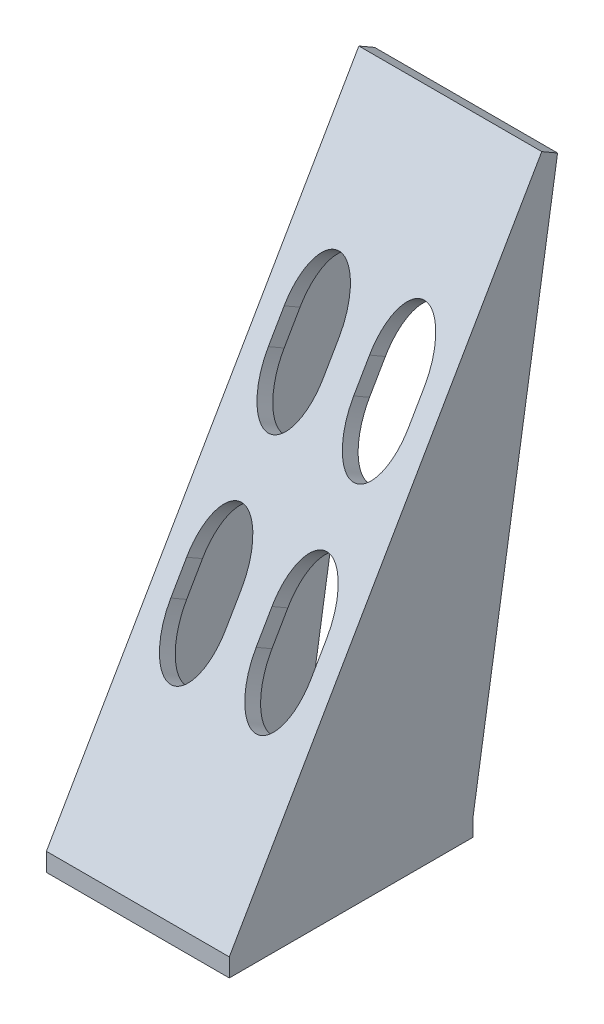
ISO-10303-21;
HEADER;
FILE_DESCRIPTION(('STEP AP214'),'2;1');
FILE_NAME('part.step','',(''),(''),'','','');
FILE_SCHEMA(('AUTOMOTIVE_DESIGN { 1 0 10303 214 1 1 1 1 }'));
ENDSEC;
DATA;
#1=APPLICATION_CONTEXT('core data for automotive mechanical design processes');
#2=APPLICATION_PROTOCOL_DEFINITION('international standard','automotive_design',2000,#1);
#3=PRODUCT_CONTEXT('',#1,'mechanical');
#4=PRODUCT('Part','Part','',(#3));
#5=PRODUCT_RELATED_PRODUCT_CATEGORY('part','',(#4));
#6=PRODUCT_DEFINITION_FORMATION('','',#4);
#7=PRODUCT_DEFINITION_CONTEXT('part definition',#1,'design');
#8=PRODUCT_DEFINITION('design','',#6,#7);
#9=PRODUCT_DEFINITION_SHAPE('','',#8);
#10=(LENGTH_UNIT() NAMED_UNIT(*) SI_UNIT(.MILLI.,.METRE.));
#11=(NAMED_UNIT(*) PLANE_ANGLE_UNIT() SI_UNIT($,.RADIAN.));
#12=(NAMED_UNIT(*) SI_UNIT($,.STERADIAN.) SOLID_ANGLE_UNIT());
#13=UNCERTAINTY_MEASURE_WITH_UNIT(LENGTH_MEASURE(1.E-05),#10,'distance_accuracy_value','');
#14=(GEOMETRIC_REPRESENTATION_CONTEXT(3) GLOBAL_UNCERTAINTY_ASSIGNED_CONTEXT((#13)) GLOBAL_UNIT_ASSIGNED_CONTEXT((#10,
#11,#12)) REPRESENTATION_CONTEXT('',''));
#15=CARTESIAN_POINT('',(0.,0.,0.));
#16=DIRECTION('',(0.,0.,1.));
#17=DIRECTION('',(1.,0.,0.));
#18=AXIS2_PLACEMENT_3D('',#15,#16,#17);
#19=CARTESIAN_POINT('',(6.99999999999998,6.48780366869484,-108.458946838995));
#20=DIRECTION('',(0.,0.500000000000001,0.866025403784438));
#21=DIRECTION('',(0.,-0.866025403784438,0.500000000000001));
#22=AXIS2_PLACEMENT_3D('',#19,#20,#21);
#23=ELLIPSE('',#22,8.99999999999998,4.5);
#24=DIRECTION('',(0.,0.500000000000001,0.866025403784438));
#25=VECTOR('',#24,1.);
#26=SURFACE_OF_LINEAR_EXTRUSION('',#23,#25);
#27=CARTESIAN_POINT('',(7.,62.987803668695,-10.5980762113533));
#28=DIRECTION('',(0.,0.500000000000001,0.866025403784438));
#29=DIRECTION('',(0.,-0.866025403784438,0.500000000000001));
#30=AXIS2_PLACEMENT_3D('',#27,#28,#29);
#31=ELLIPSE('',#30,8.99999999999998,4.5);
#32=CARTESIAN_POINT('',(2.5,62.987803668695,-10.5980762113533));
#33=VERTEX_POINT('',#32);
#34=CARTESIAN_POINT('',(11.5,62.9878036686948,-10.5980762113532));
#35=VERTEX_POINT('',#34);
#36=EDGE_CURVE('E229',#33,#35,#31,.F.);
#37=ORIENTED_EDGE('',*,*,#36,.T.);
#38=DIRECTION('',(0.,-0.500000000000001,-0.866025403784438));
#39=VECTOR('',#38,1.);
#40=CARTESIAN_POINT('',(11.5,120.987803668695,89.8608706276416));
#41=LINE('',#40,#39);
#42=CARTESIAN_POINT('',(11.5,64.4878036686949,-7.99999999999991));
#43=VERTEX_POINT('',#42);
#44=EDGE_CURVE('E836',#43,#35,#41,.T.);
#45=ORIENTED_EDGE('',*,*,#44,.F.);
#46=CARTESIAN_POINT('',(7.,64.487803668695,-8.));
#47=DIRECTION('',(0.,0.500000000000001,0.866025403784438));
#48=DIRECTION('',(0.,-0.866025403784438,0.500000000000001));
#49=AXIS2_PLACEMENT_3D('',#46,#47,#48);
#50=ELLIPSE('',#49,8.99999999999998,4.5);
#51=CARTESIAN_POINT('',(2.5,64.487803668695,-7.99999999999998));
#52=VERTEX_POINT('',#51);
#53=EDGE_CURVE('E356',#52,#43,#50,.F.);
#54=ORIENTED_EDGE('',*,*,#53,.F.);
#55=DIRECTION('',(0.,-0.500000000000001,-0.866025403784438));
#56=VECTOR('',#55,1.);
#57=CARTESIAN_POINT('',(2.50000000000001,120.987803668695,89.8608706276415));
#58=LINE('',#57,#56);
#59=EDGE_CURVE('E835',#52,#33,#58,.T.);
#60=ORIENTED_EDGE('',*,*,#59,.T.);
#61=EDGE_LOOP('',(#37,#45,#54,#60));
#62=FACE_BOUND('',#61,.T.);
#63=ADVANCED_FACE('F37',(#62),#26,.F.);
#64=CARTESIAN_POINT('',(6.99999999999999,-21.2250092524071,-92.4589468389948));
#65=DIRECTION('',(0.,0.500000000000001,0.866025403784438));
#66=DIRECTION('',(0.,-0.866025403784438,0.500000000000001));
#67=AXIS2_PLACEMENT_3D('',#64,#65,#66);
#68=ELLIPSE('',#67,8.99999999999998,4.5);
#69=DIRECTION('',(0.,0.500000000000001,0.866025403784438));
#70=VECTOR('',#69,1.);
#71=SURFACE_OF_LINEAR_EXTRUSION('',#68,#70);
#72=CARTESIAN_POINT('',(7.,35.274990747593,5.40192378864668));
#73=DIRECTION('',(0.,0.500000000000001,0.866025403784438));
#74=DIRECTION('',(0.,-0.866025403784438,0.500000000000001));
#75=AXIS2_PLACEMENT_3D('',#72,#73,#74);
#76=ELLIPSE('',#75,8.99999999999998,4.5);
#77=CARTESIAN_POINT('',(2.5,35.274990747593,5.40192378864667));
#78=VERTEX_POINT('',#77);
#79=CARTESIAN_POINT('',(11.5,35.274990747593,5.40192378864667));
#80=VERTEX_POINT('',#79);
#81=EDGE_CURVE('E236',#78,#80,#76,.F.);
#82=ORIENTED_EDGE('',*,*,#81,.T.);
#83=DIRECTION('',(0.,-0.500000000000001,-0.866025403784438));
#84=VECTOR('',#83,1.);
#85=CARTESIAN_POINT('',(11.5,93.2749907475932,105.860870627641));
#86=LINE('',#85,#84);
#87=CARTESIAN_POINT('',(11.5,36.7749907475931,7.99999999999999));
#88=VERTEX_POINT('',#87);
#89=EDGE_CURVE('E225',#88,#80,#86,.T.);
#90=ORIENTED_EDGE('',*,*,#89,.F.);
#91=CARTESIAN_POINT('',(7.,36.774990747593,8.));
#92=DIRECTION('',(0.,0.500000000000001,0.866025403784438));
#93=DIRECTION('',(0.,-0.866025403784438,0.500000000000001));
#94=AXIS2_PLACEMENT_3D('',#91,#92,#93);
#95=ELLIPSE('',#94,8.99999999999998,4.5);
#96=CARTESIAN_POINT('',(2.5,36.7749907475931,8.00000000000001));
#97=VERTEX_POINT('',#96);
#98=EDGE_CURVE('E360',#97,#88,#95,.F.);
#99=ORIENTED_EDGE('',*,*,#98,.F.);
#100=DIRECTION('',(0.,-0.500000000000001,-0.866025403784438));
#101=VECTOR('',#100,1.);
#102=CARTESIAN_POINT('',(2.50000000000001,93.2749907475932,105.860870627641));
#103=LINE('',#102,#101);
#104=EDGE_CURVE('E387',#97,#78,#103,.T.);
#105=ORIENTED_EDGE('',*,*,#104,.T.);
#106=EDGE_LOOP('',(#82,#90,#99,#105));
#107=FACE_BOUND('',#106,.T.);
#108=ADVANCED_FACE('F246',(#107),#71,.F.);
#109=CARTESIAN_POINT('',(-7.00000000000002,-21.2250092524071,-92.4589468389948));
#110=DIRECTION('',(0.,0.500000000000001,0.866025403784438));
#111=DIRECTION('',(0.,-0.866025403784438,0.500000000000001));
#112=AXIS2_PLACEMENT_3D('',#109,#110,#111);
#113=ELLIPSE('',#112,8.99999999999998,4.5);
#114=DIRECTION('',(0.,0.500000000000001,0.866025403784438));
#115=VECTOR('',#114,1.);
#116=SURFACE_OF_LINEAR_EXTRUSION('',#113,#115);
#117=DIRECTION('',(0.,-0.500000000000001,-0.866025403784438));
#118=VECTOR('',#117,1.);
#119=CARTESIAN_POINT('',(-11.5,93.2749907475931,105.860870627642));
#120=LINE('',#119,#118);
#121=CARTESIAN_POINT('',(-11.5,36.774990747593,8.00000000000002));
#122=VERTEX_POINT('',#121);
#123=CARTESIAN_POINT('',(-11.5,35.274990747593,5.4019237886467));
#124=VERTEX_POINT('',#123);
#125=EDGE_CURVE('E213',#122,#124,#120,.T.);
#126=ORIENTED_EDGE('',*,*,#125,.T.);
#127=CARTESIAN_POINT('',(-7.,35.274990747593,5.40192378864668));
#128=DIRECTION('',(0.,0.500000000000001,0.866025403784438));
#129=DIRECTION('',(0.,-0.866025403784438,0.500000000000001));
#130=AXIS2_PLACEMENT_3D('',#127,#128,#129);
#131=ELLIPSE('',#130,8.99999999999998,4.5);
#132=CARTESIAN_POINT('',(-2.5,35.274990747593,5.4019237886467));
#133=VERTEX_POINT('',#132);
#134=EDGE_CURVE('E222',#124,#133,#131,.F.);
#135=ORIENTED_EDGE('',*,*,#134,.T.);
#136=DIRECTION('',(0.,-0.500000000000001,-0.866025403784438));
#137=VECTOR('',#136,1.);
#138=CARTESIAN_POINT('',(-2.49999999999999,93.2749907475931,105.860870627642));
#139=LINE('',#138,#137);
#140=CARTESIAN_POINT('',(-2.5,36.774990747593,8.00000000000002));
#141=VERTEX_POINT('',#140);
#142=EDGE_CURVE('E202',#141,#133,#139,.T.);
#143=ORIENTED_EDGE('',*,*,#142,.F.);
#144=CARTESIAN_POINT('',(-7.,36.774990747593,8.));
#145=DIRECTION('',(0.,0.500000000000001,0.866025403784438));
#146=DIRECTION('',(0.,-0.866025403784438,0.500000000000001));
#147=AXIS2_PLACEMENT_3D('',#144,#145,#146);
#148=ELLIPSE('',#147,8.99999999999998,4.5);
#149=EDGE_CURVE('E350',#122,#141,#148,.F.);
#150=ORIENTED_EDGE('',*,*,#149,.F.);
#151=EDGE_LOOP('',(#126,#135,#143,#150));
#152=FACE_BOUND('',#151,.T.);
#153=ADVANCED_FACE('F228',(#152),#116,.F.);
#154=CARTESIAN_POINT('',(7.00000000000001,116.487803668695,92.4589468389948));
#155=DIRECTION('',(0.,0.500000000000001,0.866025403784438));
#156=DIRECTION('',(0.,-0.866025403784438,0.500000000000001));
#157=AXIS2_PLACEMENT_3D('',#154,#155,#156);
#158=ELLIPSE('',#157,8.99999999999998,4.5);
#159=DIRECTION('',(0.,-0.500000000000001,-0.866025403784438));
#160=VECTOR('',#159,1.);
#161=SURFACE_OF_LINEAR_EXTRUSION('',#158,#160);
#162=CARTESIAN_POINT('',(7.,59.987803668695,-5.40192378864668));
#163=DIRECTION('',(0.,0.500000000000001,0.866025403784438));
#164=DIRECTION('',(0.,-0.866025403784438,0.500000000000001));
#165=AXIS2_PLACEMENT_3D('',#162,#163,#164);
#166=ELLIPSE('',#165,8.99999999999998,4.5);
#167=CARTESIAN_POINT('',(11.5,59.987803668697,-5.40192378864325));
#168=VERTEX_POINT('',#167);
#169=CARTESIAN_POINT('',(2.5,59.987803668695,-5.40192378864668));
#170=VERTEX_POINT('',#169);
#171=EDGE_CURVE('E531',#168,#170,#166,.F.);
#172=ORIENTED_EDGE('',*,*,#171,.F.);
#173=DIRECTION('',(0.,-0.500000000000001,-0.866025403784438));
#174=VECTOR('',#173,1.);
#175=CARTESIAN_POINT('',(11.5,59.237803668696,-6.70096189432162));
#176=LINE('',#175,#174);
#177=CARTESIAN_POINT('',(11.5,58.487803668695,-8.00000000000002));
#178=VERTEX_POINT('',#177);
#179=EDGE_CURVE('E373',#168,#178,#176,.T.);
#180=ORIENTED_EDGE('',*,*,#179,.T.);
#181=CARTESIAN_POINT('',(7.,58.487803668695,-8.));
#182=DIRECTION('',(0.,-0.500000000000001,-0.866025403784438));
#183=DIRECTION('',(0.,-0.866025403784438,0.500000000000001));
#184=AXIS2_PLACEMENT_3D('',#181,#182,#183);
#185=ELLIPSE('',#184,8.99999999999998,4.5);
#186=CARTESIAN_POINT('',(2.5,58.487803668695,-8.00000000000002));
#187=VERTEX_POINT('',#186);
#188=EDGE_CURVE('E359',#187,#178,#185,.F.);
#189=ORIENTED_EDGE('',*,*,#188,.F.);
#190=DIRECTION('',(0.,-0.500000000000001,-0.866025403784438));
#191=VECTOR('',#190,1.);
#192=CARTESIAN_POINT('',(2.5,59.237803668696,-6.70096189432162));
#193=LINE('',#192,#191);
#194=EDGE_CURVE('E371',#170,#187,#193,.T.);
#195=ORIENTED_EDGE('',*,*,#194,.F.);
#196=EDGE_LOOP('',(#172,#180,#189,#195));
#197=FACE_BOUND('',#196,.T.);
#198=ADVANCED_FACE('F546',(#197),#161,.T.);
#199=CARTESIAN_POINT('',(-6.99999999999999,88.7749907475932,108.458946838995));
#200=DIRECTION('',(0.,0.500000000000001,0.866025403784438));
#201=DIRECTION('',(0.,-0.866025403784438,0.500000000000001));
#202=AXIS2_PLACEMENT_3D('',#199,#200,#201);
#203=ELLIPSE('',#202,8.99999999999998,4.5);
#204=DIRECTION('',(0.,-0.500000000000001,-0.866025403784438));
#205=VECTOR('',#204,1.);
#206=SURFACE_OF_LINEAR_EXTRUSION('',#203,#205);
#207=DIRECTION('',(0.,-0.500000000000001,-0.866025403784438));
#208=VECTOR('',#207,1.);
#209=CARTESIAN_POINT('',(-11.5,31.524990747594,9.29903810567838));
#210=LINE('',#209,#208);
#211=CARTESIAN_POINT('',(-11.5,32.274990747593,10.5980762113533));
#212=VERTEX_POINT('',#211);
#213=CARTESIAN_POINT('',(-11.5,30.774990747593,8.));
#214=VERTEX_POINT('',#213);
#215=EDGE_CURVE('E369',#212,#214,#210,.T.);
#216=ORIENTED_EDGE('',*,*,#215,.F.);
#217=CARTESIAN_POINT('',(-7.,32.274990747593,10.5980762113533));
#218=DIRECTION('',(0.,0.500000000000001,0.866025403784438));
#219=DIRECTION('',(0.,-0.866025403784438,0.500000000000001));
#220=AXIS2_PLACEMENT_3D('',#217,#218,#219);
#221=ELLIPSE('',#220,8.99999999999998,4.5);
#222=CARTESIAN_POINT('',(-2.5,32.274990747595,10.5980762113568));
#223=VERTEX_POINT('',#222);
#224=EDGE_CURVE('E561',#223,#212,#221,.F.);
#225=ORIENTED_EDGE('',*,*,#224,.F.);
#226=DIRECTION('',(0.,-0.500000000000001,-0.866025403784438));
#227=VECTOR('',#226,1.);
#228=CARTESIAN_POINT('',(-2.5,31.524990747594,9.29903810567839));
#229=LINE('',#228,#227);
#230=CARTESIAN_POINT('',(-2.5,30.774990747593,8.));
#231=VERTEX_POINT('',#230);
#232=EDGE_CURVE('E367',#223,#231,#229,.T.);
#233=ORIENTED_EDGE('',*,*,#232,.T.);
#234=CARTESIAN_POINT('',(-7.,30.774990747593,8.));
#235=DIRECTION('',(0.,-0.500000000000001,-0.866025403784438));
#236=DIRECTION('',(0.,-0.866025403784438,0.500000000000001));
#237=AXIS2_PLACEMENT_3D('',#234,#235,#236);
#238=ELLIPSE('',#237,8.99999999999998,4.5);
#239=EDGE_CURVE('E224',#214,#231,#238,.F.);
#240=ORIENTED_EDGE('',*,*,#239,.F.);
#241=EDGE_LOOP('',(#216,#225,#233,#240));
#242=FACE_BOUND('',#241,.T.);
#243=ADVANCED_FACE('F542',(#242),#206,.T.);
#244=CARTESIAN_POINT('',(-7.00000000000002,6.48780366869484,-108.458946838995));
#245=DIRECTION('',(0.,0.500000000000001,0.866025403784438));
#246=DIRECTION('',(0.,-0.866025403784438,0.500000000000001));
#247=AXIS2_PLACEMENT_3D('',#244,#245,#246);
#248=ELLIPSE('',#247,8.99999999999998,4.5);
#249=DIRECTION('',(0.,0.500000000000001,0.866025403784438));
#250=VECTOR('',#249,1.);
#251=SURFACE_OF_LINEAR_EXTRUSION('',#248,#250);
#252=CARTESIAN_POINT('',(-7.,62.987803668695,-10.5980762113533));
#253=DIRECTION('',(0.,0.500000000000001,0.866025403784438));
#254=DIRECTION('',(0.,-0.866025403784438,0.500000000000001));
#255=AXIS2_PLACEMENT_3D('',#252,#253,#254);
#256=ELLIPSE('',#255,8.99999999999998,4.5);
#257=CARTESIAN_POINT('',(-11.5,62.9878036686951,-10.5980762113534));
#258=VERTEX_POINT('',#257);
#259=CARTESIAN_POINT('',(-2.5,62.987803668695,-10.5980762113533));
#260=VERTEX_POINT('',#259);
#261=EDGE_CURVE('E230',#258,#260,#256,.F.);
#262=ORIENTED_EDGE('',*,*,#261,.T.);
#263=DIRECTION('',(0.,-0.500000000000001,-0.866025403784438));
#264=VECTOR('',#263,1.);
#265=CARTESIAN_POINT('',(-2.49999999999999,120.987803668695,89.8608706276415));
#266=LINE('',#265,#264);
#267=CARTESIAN_POINT('',(-2.5,64.487803668695,-7.99999999999999));
#268=VERTEX_POINT('',#267);
#269=EDGE_CURVE('E533',#268,#260,#266,.T.);
#270=ORIENTED_EDGE('',*,*,#269,.F.);
#271=CARTESIAN_POINT('',(-7.,64.487803668695,-8.));
#272=DIRECTION('',(0.,0.500000000000001,0.866025403784438));
#273=DIRECTION('',(0.,-0.866025403784438,0.500000000000001));
#274=AXIS2_PLACEMENT_3D('',#271,#272,#273);
#275=ELLIPSE('',#274,8.99999999999998,4.5);
#276=CARTESIAN_POINT('',(-11.5,64.4878036686951,-8.00000000000008));
#277=VERTEX_POINT('',#276);
#278=EDGE_CURVE('E233',#277,#268,#275,.F.);
#279=ORIENTED_EDGE('',*,*,#278,.F.);
#280=DIRECTION('',(0.,-0.500000000000001,-0.866025403784438));
#281=VECTOR('',#280,1.);
#282=CARTESIAN_POINT('',(-11.5,120.987803668695,89.8608706276414));
#283=LINE('',#282,#281);
#284=EDGE_CURVE('E850',#277,#258,#283,.T.);
#285=ORIENTED_EDGE('',*,*,#284,.T.);
#286=EDGE_LOOP('',(#262,#270,#279,#285));
#287=FACE_BOUND('',#286,.T.);
#288=ADVANCED_FACE('F248',(#287),#251,.F.);
#289=CARTESIAN_POINT('',(-6.99999999999999,116.487803668695,92.4589468389948));
#290=DIRECTION('',(0.,0.500000000000001,0.866025403784438));
#291=DIRECTION('',(0.,-0.866025403784438,0.500000000000001));
#292=AXIS2_PLACEMENT_3D('',#289,#290,#291);
#293=ELLIPSE('',#292,8.99999999999998,4.5);
#294=DIRECTION('',(0.,-0.500000000000001,-0.866025403784438));
#295=VECTOR('',#294,1.);
#296=SURFACE_OF_LINEAR_EXTRUSION('',#293,#295);
#297=CARTESIAN_POINT('',(-7.,59.987803668695,-5.40192378864668));
#298=DIRECTION('',(0.,0.500000000000001,0.866025403784438));
#299=DIRECTION('',(0.,-0.866025403784438,0.500000000000001));
#300=AXIS2_PLACEMENT_3D('',#297,#298,#299);
#301=ELLIPSE('',#300,8.99999999999998,4.5);
#302=CARTESIAN_POINT('',(-2.5,59.987803668697,-5.40192378864321));
#303=VERTEX_POINT('',#302);
#304=CARTESIAN_POINT('',(-11.5,59.987803668695,-5.40192378864668));
#305=VERTEX_POINT('',#304);
#306=EDGE_CURVE('E519',#303,#305,#301,.F.);
#307=ORIENTED_EDGE('',*,*,#306,.F.);
#308=DIRECTION('',(0.,-0.500000000000001,-0.866025403784438));
#309=VECTOR('',#308,1.);
#310=CARTESIAN_POINT('',(-2.5,59.237803668696,-6.70096189432159));
#311=LINE('',#310,#309);
#312=CARTESIAN_POINT('',(-2.5,58.487803668695,-8.00000000000002));
#313=VERTEX_POINT('',#312);
#314=EDGE_CURVE('E364',#303,#313,#311,.T.);
#315=ORIENTED_EDGE('',*,*,#314,.T.);
#316=CARTESIAN_POINT('',(-7.,58.487803668695,-8.));
#317=DIRECTION('',(0.,-0.500000000000001,-0.866025403784438));
#318=DIRECTION('',(0.,-0.866025403784438,0.500000000000001));
#319=AXIS2_PLACEMENT_3D('',#316,#317,#318);
#320=ELLIPSE('',#319,8.99999999999998,4.5);
#321=CARTESIAN_POINT('',(-11.5,58.487803668695,-8.00000000000001));
#322=VERTEX_POINT('',#321);
#323=EDGE_CURVE('E355',#322,#313,#320,.F.);
#324=ORIENTED_EDGE('',*,*,#323,.F.);
#325=DIRECTION('',(0.,-0.500000000000001,-0.866025403784438));
#326=VECTOR('',#325,1.);
#327=CARTESIAN_POINT('',(-11.5,59.237803668696,-6.7009618943216));
#328=LINE('',#327,#326);
#329=EDGE_CURVE('E349',#305,#322,#328,.T.);
#330=ORIENTED_EDGE('',*,*,#329,.F.);
#331=EDGE_LOOP('',(#307,#315,#324,#330));
#332=FACE_BOUND('',#331,.T.);
#333=ADVANCED_FACE('F303',(#332),#296,.T.);
#334=CARTESIAN_POINT('',(0.,3.,0.));
#335=DIRECTION('',(0.,1.,0.));
#336=DIRECTION('',(0.,0.,1.));
#337=AXIS2_PLACEMENT_3D('',#334,#335,#336);
#338=PLANE('',#337);
#339=DIRECTION('',(-1.,0.,0.));
#340=VECTOR('',#339,1.);
#341=CARTESIAN_POINT('',(-15.,3.,-12.5));
#342=LINE('',#341,#340);
#343=CARTESIAN_POINT('',(12.,3.,-12.5));
#344=VERTEX_POINT('',#343);
#345=CARTESIAN_POINT('',(-12.,3.,-12.5));
#346=VERTEX_POINT('',#345);
#347=EDGE_CURVE('E343',#344,#346,#342,.T.);
#348=ORIENTED_EDGE('',*,*,#347,.T.);
#349=DIRECTION('',(0.,0.,1.));
#350=VECTOR('',#349,1.);
#351=CARTESIAN_POINT('',(-12.,3.,-12.5));
#352=LINE('',#351,#350);
#353=CARTESIAN_POINT('',(-12.,3.,24.0358983848623));
#354=VERTEX_POINT('',#353);
#355=EDGE_CURVE('E398',#346,#354,#352,.T.);
#356=ORIENTED_EDGE('',*,*,#355,.T.);
#357=DIRECTION('',(1.,0.,0.));
#358=VECTOR('',#357,1.);
#359=CARTESIAN_POINT('',(-118.823421305906,3.,24.0358983848623));
#360=LINE('',#359,#358);
#361=CARTESIAN_POINT('',(12.,3.,24.0358983848623));
#362=VERTEX_POINT('',#361);
#363=EDGE_CURVE('E433',#354,#362,#360,.T.);
#364=ORIENTED_EDGE('',*,*,#363,.T.);
#365=DIRECTION('',(0.,0.,-1.));
#366=VECTOR('',#365,1.);
#367=CARTESIAN_POINT('',(12.,3.,24.0358983848623));
#368=LINE('',#367,#366);
#369=EDGE_CURVE('E414',#362,#344,#368,.T.);
#370=ORIENTED_EDGE('',*,*,#369,.T.);
#371=EDGE_LOOP('',(#348,#356,#364,#370));
#372=FACE_BOUND('',#371,.T.);
#373=CARTESIAN_POINT('',(-7.,3.,8.));
#374=DIRECTION('',(0.,1.,0.));
#375=DIRECTION('',(0.,0.,1.));
#376=AXIS2_PLACEMENT_3D('',#373,#374,#375);
#377=CIRCLE('',#376,1.6);
#378=CARTESIAN_POINT('',(-7.,3.,9.6));
#379=VERTEX_POINT('',#378);
#380=EDGE_CURVE('E447',#379,#379,#377,.T.);
#381=ORIENTED_EDGE('',*,*,#380,.F.);
#382=EDGE_LOOP('',(#381));
#383=FACE_BOUND('',#382,.T.);
#384=CARTESIAN_POINT('',(-7.,3.,-8.));
#385=DIRECTION('',(0.,1.,0.));
#386=DIRECTION('',(0.,0.,1.));
#387=AXIS2_PLACEMENT_3D('',#384,#385,#386);
#388=CIRCLE('',#387,1.6);
#389=CARTESIAN_POINT('',(-7.,3.,-6.4));
#390=VERTEX_POINT('',#389);
#391=EDGE_CURVE('E451',#390,#390,#388,.T.);
#392=ORIENTED_EDGE('',*,*,#391,.F.);
#393=EDGE_LOOP('',(#392));
#394=FACE_BOUND('',#393,.T.);
#395=CARTESIAN_POINT('',(7.,3.,-8.));
#396=DIRECTION('',(0.,1.,0.));
#397=DIRECTION('',(0.,0.,1.));
#398=AXIS2_PLACEMENT_3D('',#395,#396,#397);
#399=CIRCLE('',#398,1.6);
#400=CARTESIAN_POINT('',(7.,3.,-6.4));
#401=VERTEX_POINT('',#400);
#402=EDGE_CURVE('E452',#401,#401,#399,.T.);
#403=ORIENTED_EDGE('',*,*,#402,.F.);
#404=EDGE_LOOP('',(#403));
#405=FACE_BOUND('',#404,.T.);
#406=CARTESIAN_POINT('',(7.,3.,8.));
#407=DIRECTION('',(0.,1.,0.));
#408=DIRECTION('',(0.,0.,1.));
#409=AXIS2_PLACEMENT_3D('',#406,#407,#408);
#410=CIRCLE('',#409,1.6);
#411=CARTESIAN_POINT('',(7.,3.,9.6));
#412=VERTEX_POINT('',#411);
#413=EDGE_CURVE('E458',#412,#412,#410,.T.);
#414=ORIENTED_EDGE('',*,*,#413,.F.);
#415=EDGE_LOOP('',(#414));
#416=FACE_BOUND('',#415,.T.);
#417=ADVANCED_FACE('F279',(#372,#383,#394,#405,#416),#338,.T.);
#418=CARTESIAN_POINT('',(-118.823421305906,3.,24.0358983848623));
#419=DIRECTION('',(0.,-0.500000000000001,-0.866025403784438));
#420=DIRECTION('',(0.,0.866025403784438,-0.500000000000001));
#421=AXIS2_PLACEMENT_3D('',#418,#419,#420);
#422=PLANE('',#421);
#423=DIRECTION('',(0.,-0.866025403784438,0.500000000000001));
#424=VECTOR('',#423,1.);
#425=CARTESIAN_POINT('',(11.5,30.774990747593,8.00000000000001));
#426=LINE('',#425,#424);
#427=CARTESIAN_POINT('',(11.5,30.774990747593,8.00000000000001));
#428=VERTEX_POINT('',#427);
#429=EDGE_CURVE('E388',#80,#428,#426,.T.);
#430=ORIENTED_EDGE('',*,*,#429,.F.);
#431=ORIENTED_EDGE('',*,*,#81,.F.);
#432=DIRECTION('',(0.,0.866025403784438,-0.500000000000001));
#433=VECTOR('',#432,1.);
#434=CARTESIAN_POINT('',(2.5,30.774990747593,8.00000000000001));
#435=LINE('',#434,#433);
#436=CARTESIAN_POINT('',(2.5,30.774990747593,8.00000000000001));
#437=VERTEX_POINT('',#436);
#438=EDGE_CURVE('E377',#437,#78,#435,.T.);
#439=ORIENTED_EDGE('',*,*,#438,.F.);
#440=CARTESIAN_POINT('',(7.,30.774990747593,8.));
#441=DIRECTION('',(0.,-0.500000000000001,-0.866025403784438));
#442=DIRECTION('',(0.,-0.866025403784438,0.500000000000001));
#443=AXIS2_PLACEMENT_3D('',#440,#441,#442);
#444=ELLIPSE('',#443,8.99999999999998,4.5);
#445=EDGE_CURVE('E352',#437,#428,#444,.F.);
#446=ORIENTED_EDGE('',*,*,#445,.T.);
#447=EDGE_LOOP('',(#430,#431,#439,#446));
#448=FACE_BOUND('',#447,.T.);
#449=DIRECTION('',(0.,0.866025403784438,-0.500000000000001));
#450=VECTOR('',#449,1.);
#451=CARTESIAN_POINT('',(-11.5,30.774990747593,8.));
#452=LINE('',#451,#450);
#453=EDGE_CURVE('E214',#214,#124,#452,.T.);
#454=ORIENTED_EDGE('',*,*,#453,.F.);
#455=ORIENTED_EDGE('',*,*,#239,.T.);
#456=DIRECTION('',(0.,-0.866025403784438,0.500000000000001));
#457=VECTOR('',#456,1.);
#458=CARTESIAN_POINT('',(-2.5,35.274990747593,5.4019237886467));
#459=LINE('',#458,#457);
#460=EDGE_CURVE('E205',#133,#231,#459,.T.);
#461=ORIENTED_EDGE('',*,*,#460,.F.);
#462=ORIENTED_EDGE('',*,*,#134,.F.);
#463=EDGE_LOOP('',(#454,#455,#461,#462));
#464=FACE_BOUND('',#463,.T.);
#465=DIRECTION('',(0.,-0.866025403784438,0.500000000000001));
#466=VECTOR('',#465,1.);
#467=CARTESIAN_POINT('',(11.5,62.9878036686948,-10.5980762113532));
#468=LINE('',#467,#466);
#469=EDGE_CURVE('E833',#35,#178,#468,.T.);
#470=ORIENTED_EDGE('',*,*,#469,.F.);
#471=ORIENTED_EDGE('',*,*,#36,.F.);
#472=DIRECTION('',(0.,0.866025403784438,-0.500000000000002));
#473=VECTOR('',#472,1.);
#474=CARTESIAN_POINT('',(2.5,58.487803668695,-8.00000000000002));
#475=LINE('',#474,#473);
#476=EDGE_CURVE('E831',#187,#33,#475,.T.);
#477=ORIENTED_EDGE('',*,*,#476,.F.);
#478=ORIENTED_EDGE('',*,*,#188,.T.);
#479=EDGE_LOOP('',(#470,#471,#477,#478));
#480=FACE_BOUND('',#479,.T.);
#481=DIRECTION('',(0.,-0.866025403784438,0.500000000000001));
#482=VECTOR('',#481,1.);
#483=CARTESIAN_POINT('',(-2.5,58.487803668695,-8.00000000000002));
#484=LINE('',#483,#482);
#485=EDGE_CURVE('E513',#260,#313,#484,.T.);
#486=ORIENTED_EDGE('',*,*,#485,.F.);
#487=ORIENTED_EDGE('',*,*,#261,.F.);
#488=DIRECTION('',(0.,0.866025403784438,-0.500000000000002));
#489=VECTOR('',#488,1.);
#490=CARTESIAN_POINT('',(-11.5,62.9878036686951,-10.5980762113534));
#491=LINE('',#490,#489);
#492=EDGE_CURVE('E514',#322,#258,#491,.T.);
#493=ORIENTED_EDGE('',*,*,#492,.F.);
#494=ORIENTED_EDGE('',*,*,#323,.T.);
#495=EDGE_LOOP('',(#486,#487,#493,#494));
#496=FACE_BOUND('',#495,.T.);
#497=ORIENTED_EDGE('',*,*,#363,.F.);
#498=DIRECTION('',(0.,0.866025403784438,-0.500000000000001));
#499=VECTOR('',#498,1.);
#500=CARTESIAN_POINT('',(-12.,3.,24.0358983848623));
#501=LINE('',#500,#499);
#502=CARTESIAN_POINT('',(-12.,90.2676038879049,-26.3480762113534));
#503=VERTEX_POINT('',#502);
#504=EDGE_CURVE('E401',#354,#503,#501,.T.);
#505=ORIENTED_EDGE('',*,*,#504,.T.);
#506=DIRECTION('',(1.,0.,0.));
#507=VECTOR('',#506,1.);
#508=CARTESIAN_POINT('',(-118.823421305906,90.2676038879049,-26.3480762113534));
#509=LINE('',#508,#507);
#510=CARTESIAN_POINT('',(12.,90.2676038879049,-26.3480762113534));
#511=VERTEX_POINT('',#510);
#512=EDGE_CURVE('E437',#503,#511,#509,.T.);
#513=ORIENTED_EDGE('',*,*,#512,.T.);
#514=DIRECTION('',(0.,-0.866025403784437,0.500000000000003));
#515=VECTOR('',#514,1.);
#516=CARTESIAN_POINT('',(12.,90.2676038879049,-26.3480762113534));
#517=LINE('',#516,#515);
#518=EDGE_CURVE('E411',#511,#362,#517,.T.);
#519=ORIENTED_EDGE('',*,*,#518,.T.);
#520=EDGE_LOOP('',(#497,#505,#513,#519));
#521=FACE_BOUND('',#520,.T.);
#522=ADVANCED_FACE('F220',(#448,#464,#480,#496,#521),#422,.T.);
#523=CARTESIAN_POINT('',(15.,3.,-12.5));
#524=DIRECTION('',(-1.,0.,0.));
#525=DIRECTION('',(0.,0.,1.));
#526=AXIS2_PLACEMENT_3D('',#523,#524,#525);
#527=PLANE('',#526);
#528=DIRECTION('',(0.,-1.,0.));
#529=VECTOR('',#528,1.);
#530=CARTESIAN_POINT('',(15.,3.,-12.5));
#531=LINE('',#530,#529);
#532=CARTESIAN_POINT('',(15.,3.,-12.5));
#533=VERTEX_POINT('',#532);
#534=CARTESIAN_POINT('',(15.,0.,-12.5));
#535=VERTEX_POINT('',#534);
#536=EDGE_CURVE('E326',#533,#535,#531,.T.);
#537=ORIENTED_EDGE('',*,*,#536,.F.);
#538=DIRECTION('',(0.,0.987642404109211,-0.156724221501907));
#539=VECTOR('',#538,1.);
#540=CARTESIAN_POINT('',(15.,3.,-12.5));
#541=LINE('',#540,#539);
#542=CARTESIAN_POINT('',(15.,90.2676038879049,-26.3480762113534));
#543=VERTEX_POINT('',#542);
#544=EDGE_CURVE('E407',#533,#543,#541,.T.);
#545=ORIENTED_EDGE('',*,*,#544,.T.);
#546=DIRECTION('',(0.,0.5,0.866025403784439));
#547=VECTOR('',#546,1.);
#548=CARTESIAN_POINT('',(15.,90.2676038879049,-26.3480762113534));
#549=LINE('',#548,#547);
#550=CARTESIAN_POINT('',(15.,91.7676038879049,-23.7500000000001));
#551=VERTEX_POINT('',#550);
#552=EDGE_CURVE('E421',#543,#551,#549,.T.);
#553=ORIENTED_EDGE('',*,*,#552,.T.);
#554=DIRECTION('',(0.,-0.866025403784438,0.500000000000001));
#555=VECTOR('',#554,1.);
#556=CARTESIAN_POINT('',(15.,3.,27.5));
#557=LINE('',#556,#555);
#558=CARTESIAN_POINT('',(15.,3.,27.5));
#559=VERTEX_POINT('',#558);
#560=EDGE_CURVE('E430',#551,#559,#557,.T.);
#561=ORIENTED_EDGE('',*,*,#560,.T.);
#562=DIRECTION('',(0.,1.,0.));
#563=VECTOR('',#562,1.);
#564=CARTESIAN_POINT('',(15.,0.,27.5));
#565=LINE('',#564,#563);
#566=CARTESIAN_POINT('',(15.,0.,27.5));
#567=VERTEX_POINT('',#566);
#568=EDGE_CURVE('E441',#567,#559,#565,.T.);
#569=ORIENTED_EDGE('',*,*,#568,.F.);
#570=DIRECTION('',(0.,0.,-1.));
#571=VECTOR('',#570,1.);
#572=CARTESIAN_POINT('',(15.,0.,-12.5));
#573=LINE('',#572,#571);
#574=EDGE_CURVE('E331',#567,#535,#573,.T.);
#575=ORIENTED_EDGE('',*,*,#574,.T.);
#576=EDGE_LOOP('',(#537,#545,#553,#561,#569,#575));
#577=FACE_BOUND('',#576,.T.);
#578=ADVANCED_FACE('F39',(#577),#527,.F.);
#579=CARTESIAN_POINT('',(-15.,3.,-12.5));
#580=DIRECTION('',(0.,0.,1.));
#581=DIRECTION('',(1.,0.,0.));
#582=AXIS2_PLACEMENT_3D('',#579,#580,#581);
#583=PLANE('',#582);
#584=DIRECTION('',(-1.,0.,0.));
#585=VECTOR('',#584,1.);
#586=CARTESIAN_POINT('',(-15.,0.,-12.5));
#587=LINE('',#586,#585);
#588=CARTESIAN_POINT('',(-15.,0.,-12.5));
#589=VERTEX_POINT('',#588);
#590=EDGE_CURVE('E320',#535,#589,#587,.T.);
#591=ORIENTED_EDGE('',*,*,#590,.T.);
#592=DIRECTION('',(0.,-1.,0.));
#593=VECTOR('',#592,1.);
#594=CARTESIAN_POINT('',(-15.,3.,-12.5));
#595=LINE('',#594,#593);
#596=CARTESIAN_POINT('',(-15.,3.,-12.5));
#597=VERTEX_POINT('',#596);
#598=EDGE_CURVE('E323',#597,#589,#595,.T.);
#599=ORIENTED_EDGE('',*,*,#598,.F.);
#600=DIRECTION('',(-1.,0.,0.));
#601=VECTOR('',#600,1.);
#602=CARTESIAN_POINT('',(-12.,3.,-12.5));
#603=LINE('',#602,#601);
#604=EDGE_CURVE('E404',#346,#597,#603,.T.);
#605=ORIENTED_EDGE('',*,*,#604,.F.);
#606=ORIENTED_EDGE('',*,*,#347,.F.);
#607=EDGE_CURVE('E338',#533,#344,#342,.T.);
#608=ORIENTED_EDGE('',*,*,#607,.F.);
#609=ORIENTED_EDGE('',*,*,#536,.T.);
#610=EDGE_LOOP('',(#591,#599,#605,#606,#608,#609));
#611=FACE_BOUND('',#610,.T.);
#612=ADVANCED_FACE('F310',(#611),#583,.F.);
#613=CARTESIAN_POINT('',(-15.,3.,-12.5));
#614=DIRECTION('',(1.,0.,0.));
#615=DIRECTION('',(0.,0.,-1.));
#616=AXIS2_PLACEMENT_3D('',#613,#614,#615);
#617=PLANE('',#616);
#618=DIRECTION('',(0.,0.,1.));
#619=VECTOR('',#618,1.);
#620=CARTESIAN_POINT('',(-15.,0.,-12.5));
#621=LINE('',#620,#619);
#622=CARTESIAN_POINT('',(-15.,0.,27.5));
#623=VERTEX_POINT('',#622);
#624=EDGE_CURVE('E330',#589,#623,#621,.T.);
#625=ORIENTED_EDGE('',*,*,#624,.T.);
#626=DIRECTION('',(0.,-1.,0.));
#627=VECTOR('',#626,1.);
#628=CARTESIAN_POINT('',(-15.,3.,27.5));
#629=LINE('',#628,#627);
#630=CARTESIAN_POINT('',(-15.,3.,27.5));
#631=VERTEX_POINT('',#630);
#632=EDGE_CURVE('E427',#631,#623,#629,.T.);
#633=ORIENTED_EDGE('',*,*,#632,.F.);
#634=DIRECTION('',(0.,0.866025403784438,-0.500000000000001));
#635=VECTOR('',#634,1.);
#636=CARTESIAN_POINT('',(-15.,3.,27.5));
#637=LINE('',#636,#635);
#638=CARTESIAN_POINT('',(-15.,91.7676038879049,-23.7500000000001));
#639=VERTEX_POINT('',#638);
#640=EDGE_CURVE('E424',#631,#639,#637,.T.);
#641=ORIENTED_EDGE('',*,*,#640,.T.);
#642=DIRECTION('',(0.,-0.5,-0.866025403784439));
#643=VECTOR('',#642,1.);
#644=CARTESIAN_POINT('',(-15.,90.2676038879049,-26.3480762113534));
#645=LINE('',#644,#643);
#646=CARTESIAN_POINT('',(-15.,90.2676038879049,-26.3480762113534));
#647=VERTEX_POINT('',#646);
#648=EDGE_CURVE('E422',#639,#647,#645,.T.);
#649=ORIENTED_EDGE('',*,*,#648,.T.);
#650=DIRECTION('',(0.,-0.987642404109211,0.156724221501907));
#651=VECTOR('',#650,1.);
#652=CARTESIAN_POINT('',(-15.,90.2676038879049,-26.3480762113534));
#653=LINE('',#652,#651);
#654=EDGE_CURVE('E337',#647,#597,#653,.T.);
#655=ORIENTED_EDGE('',*,*,#654,.T.);
#656=ORIENTED_EDGE('',*,*,#598,.T.);
#657=EDGE_LOOP('',(#625,#633,#641,#649,#655,#656));
#658=FACE_BOUND('',#657,.T.);
#659=ADVANCED_FACE('F307',(#658),#617,.F.);
#660=CARTESIAN_POINT('',(0.,0.,0.));
#661=DIRECTION('',(0.,1.,0.));
#662=DIRECTION('',(0.,0.,1.));
#663=AXIS2_PLACEMENT_3D('',#660,#661,#662);
#664=PLANE('',#663);
#665=CARTESIAN_POINT('',(7.,0.,-8.));
#666=DIRECTION('',(0.,1.,0.));
#667=DIRECTION('',(0.,0.,1.));
#668=AXIS2_PLACEMENT_3D('',#665,#666,#667);
#669=CIRCLE('',#668,1.6);
#670=CARTESIAN_POINT('',(7.,0.,-6.4));
#671=VERTEX_POINT('',#670);
#672=EDGE_CURVE('E448',#671,#671,#669,.T.);
#673=ORIENTED_EDGE('',*,*,#672,.T.);
#674=EDGE_LOOP('',(#673));
#675=FACE_BOUND('',#674,.T.);
#676=CARTESIAN_POINT('',(7.,0.,8.));
#677=DIRECTION('',(0.,1.,0.));
#678=DIRECTION('',(0.,0.,1.));
#679=AXIS2_PLACEMENT_3D('',#676,#677,#678);
#680=CIRCLE('',#679,1.6);
#681=CARTESIAN_POINT('',(7.,0.,9.6));
#682=VERTEX_POINT('',#681);
#683=EDGE_CURVE('E455',#682,#682,#680,.T.);
#684=ORIENTED_EDGE('',*,*,#683,.T.);
#685=EDGE_LOOP('',(#684));
#686=FACE_BOUND('',#685,.T.);
#687=CARTESIAN_POINT('',(-7.,0.,8.));
#688=DIRECTION('',(0.,1.,0.));
#689=DIRECTION('',(0.,0.,1.));
#690=AXIS2_PLACEMENT_3D('',#687,#688,#689);
#691=CIRCLE('',#690,1.6);
#692=CARTESIAN_POINT('',(-7.,0.,9.6));
#693=VERTEX_POINT('',#692);
#694=EDGE_CURVE('E461',#693,#693,#691,.T.);
#695=ORIENTED_EDGE('',*,*,#694,.T.);
#696=EDGE_LOOP('',(#695));
#697=FACE_BOUND('',#696,.T.);
#698=CARTESIAN_POINT('',(-7.,0.,-8.));
#699=DIRECTION('',(0.,1.,0.));
#700=DIRECTION('',(0.,0.,1.));
#701=AXIS2_PLACEMENT_3D('',#698,#699,#700);
#702=CIRCLE('',#701,1.6);
#703=CARTESIAN_POINT('',(-7.,0.,-6.4));
#704=VERTEX_POINT('',#703);
#705=EDGE_CURVE('E466',#704,#704,#702,.T.);
#706=ORIENTED_EDGE('',*,*,#705,.T.);
#707=EDGE_LOOP('',(#706));
#708=FACE_BOUND('',#707,.T.);
#709=ORIENTED_EDGE('',*,*,#574,.F.);
#710=DIRECTION('',(1.,0.,0.));
#711=VECTOR('',#710,1.);
#712=CARTESIAN_POINT('',(-15.,0.,27.5));
#713=LINE('',#712,#711);
#714=EDGE_CURVE('E341',#623,#567,#713,.T.);
#715=ORIENTED_EDGE('',*,*,#714,.F.);
#716=ORIENTED_EDGE('',*,*,#624,.F.);
#717=ORIENTED_EDGE('',*,*,#590,.F.);
#718=EDGE_LOOP('',(#709,#715,#716,#717));
#719=FACE_BOUND('',#718,.T.);
#720=ADVANCED_FACE('F299',(#675,#686,#697,#708,#719),#664,.F.);
#721=CARTESIAN_POINT('',(-7.,0.,-8.));
#722=DIRECTION('',(0.,1.,0.));
#723=DIRECTION('',(0.,0.,1.));
#724=AXIS2_PLACEMENT_3D('',#721,#722,#723);
#725=CYLINDRICAL_SURFACE('',#724,1.6);
#726=ORIENTED_EDGE('',*,*,#705,.F.);
#727=EDGE_LOOP('',(#726));
#728=FACE_BOUND('',#727,.T.);
#729=ORIENTED_EDGE('',*,*,#391,.T.);
#730=EDGE_LOOP('',(#729));
#731=FACE_BOUND('',#730,.T.);
#732=ADVANCED_FACE('F295',(#728,#731),#725,.F.);
#733=CARTESIAN_POINT('',(-7.,0.,8.));
#734=DIRECTION('',(0.,1.,0.));
#735=DIRECTION('',(0.,0.,1.));
#736=AXIS2_PLACEMENT_3D('',#733,#734,#735);
#737=CYLINDRICAL_SURFACE('',#736,1.6);
#738=ORIENTED_EDGE('',*,*,#694,.F.);
#739=EDGE_LOOP('',(#738));
#740=FACE_BOUND('',#739,.T.);
#741=ORIENTED_EDGE('',*,*,#380,.T.);
#742=EDGE_LOOP('',(#741));
#743=FACE_BOUND('',#742,.T.);
#744=ADVANCED_FACE('F291',(#740,#743),#737,.F.);
#745=CARTESIAN_POINT('',(7.,0.,8.));
#746=DIRECTION('',(0.,1.,0.));
#747=DIRECTION('',(0.,0.,1.));
#748=AXIS2_PLACEMENT_3D('',#745,#746,#747);
#749=CYLINDRICAL_SURFACE('',#748,1.6);
#750=ORIENTED_EDGE('',*,*,#683,.F.);
#751=EDGE_LOOP('',(#750));
#752=FACE_BOUND('',#751,.T.);
#753=ORIENTED_EDGE('',*,*,#413,.T.);
#754=EDGE_LOOP('',(#753));
#755=FACE_BOUND('',#754,.T.);
#756=ADVANCED_FACE('F287',(#752,#755),#749,.F.);
#757=CARTESIAN_POINT('',(7.,0.,-8.));
#758=DIRECTION('',(0.,1.,0.));
#759=DIRECTION('',(0.,0.,1.));
#760=AXIS2_PLACEMENT_3D('',#757,#758,#759);
#761=CYLINDRICAL_SURFACE('',#760,1.6);
#762=ORIENTED_EDGE('',*,*,#672,.F.);
#763=EDGE_LOOP('',(#762));
#764=FACE_BOUND('',#763,.T.);
#765=ORIENTED_EDGE('',*,*,#402,.T.);
#766=EDGE_LOOP('',(#765));
#767=FACE_BOUND('',#766,.T.);
#768=ADVANCED_FACE('F283',(#764,#767),#761,.F.);
#769=CARTESIAN_POINT('',(0.,0.,27.5));
#770=DIRECTION('',(0.,0.,1.));
#771=DIRECTION('',(1.,0.,0.));
#772=AXIS2_PLACEMENT_3D('',#769,#770,#771);
#773=PLANE('',#772);
#774=ORIENTED_EDGE('',*,*,#632,.T.);
#775=ORIENTED_EDGE('',*,*,#714,.T.);
#776=ORIENTED_EDGE('',*,*,#568,.T.);
#777=DIRECTION('',(-1.,0.,0.));
#778=VECTOR('',#777,1.);
#779=CARTESIAN_POINT('',(15.,3.,27.5));
#780=LINE('',#779,#778);
#781=EDGE_CURVE('E444',#559,#631,#780,.T.);
#782=ORIENTED_EDGE('',*,*,#781,.T.);
#783=EDGE_LOOP('',(#774,#775,#776,#782));
#784=FACE_BOUND('',#783,.T.);
#785=ADVANCED_FACE('F272',(#784),#773,.T.);
#786=CARTESIAN_POINT('',(-118.823421305906,3.,27.5));
#787=DIRECTION('',(0.,0.500000000000001,0.866025403784438));
#788=DIRECTION('',(0.,-0.866025403784438,0.500000000000001));
#789=AXIS2_PLACEMENT_3D('',#786,#787,#788);
#790=PLANE('',#789);
#791=DIRECTION('',(0.,0.866025403784438,-0.500000000000001));
#792=VECTOR('',#791,1.);
#793=CARTESIAN_POINT('',(11.5,3.00000000000003,27.5));
#794=LINE('',#793,#792);
#795=CARTESIAN_POINT('',(11.5,32.274990747595,10.5980762113568));
#796=VERTEX_POINT('',#795);
#797=EDGE_CURVE('E824',#796,#88,#794,.T.);
#798=ORIENTED_EDGE('',*,*,#797,.F.);
#799=CARTESIAN_POINT('',(7.,32.274990747593,10.5980762113533));
#800=DIRECTION('',(0.,0.500000000000001,0.866025403784438));
#801=DIRECTION('',(0.,-0.866025403784438,0.500000000000001));
#802=AXIS2_PLACEMENT_3D('',#799,#800,#801);
#803=ELLIPSE('',#802,8.99999999999998,4.5);
#804=CARTESIAN_POINT('',(2.5,32.274990747593,10.5980762113533));
#805=VERTEX_POINT('',#804);
#806=EDGE_CURVE('E528',#796,#805,#803,.F.);
#807=ORIENTED_EDGE('',*,*,#806,.T.);
#808=DIRECTION('',(0.,-0.866025403784438,0.500000000000001));
#809=VECTOR('',#808,1.);
#810=CARTESIAN_POINT('',(2.5,2.99999999999999,27.5));
#811=LINE('',#810,#809);
#812=EDGE_CURVE('E52',#97,#805,#811,.T.);
#813=ORIENTED_EDGE('',*,*,#812,.F.);
#814=ORIENTED_EDGE('',*,*,#98,.T.);
#815=EDGE_LOOP('',(#798,#807,#813,#814));
#816=FACE_BOUND('',#815,.T.);
#817=DIRECTION('',(0.,-0.866025403784438,0.500000000000001));
#818=VECTOR('',#817,1.);
#819=CARTESIAN_POINT('',(-11.5,3.00000000000002,27.5));
#820=LINE('',#819,#818);
#821=EDGE_CURVE('E841',#122,#212,#820,.T.);
#822=ORIENTED_EDGE('',*,*,#821,.F.);
#823=ORIENTED_EDGE('',*,*,#149,.T.);
#824=DIRECTION('',(0.,0.866025403784438,-0.500000000000001));
#825=VECTOR('',#824,1.);
#826=CARTESIAN_POINT('',(-2.5,2.99999999999999,27.5));
#827=LINE('',#826,#825);
#828=EDGE_CURVE('E208',#223,#141,#827,.T.);
#829=ORIENTED_EDGE('',*,*,#828,.F.);
#830=ORIENTED_EDGE('',*,*,#224,.T.);
#831=EDGE_LOOP('',(#822,#823,#829,#830));
#832=FACE_BOUND('',#831,.T.);
#833=DIRECTION('',(0.,0.866025403784438,-0.500000000000001));
#834=VECTOR('',#833,1.);
#835=CARTESIAN_POINT('',(11.5,2.99999999999992,27.5));
#836=LINE('',#835,#834);
#837=EDGE_CURVE('E844',#168,#43,#836,.T.);
#838=ORIENTED_EDGE('',*,*,#837,.F.);
#839=ORIENTED_EDGE('',*,*,#171,.T.);
#840=DIRECTION('',(0.,-0.866025403784438,0.500000000000001));
#841=VECTOR('',#840,1.);
#842=CARTESIAN_POINT('',(2.49999999999999,2.99999999999998,27.5));
#843=LINE('',#842,#841);
#844=EDGE_CURVE('E60',#52,#170,#843,.T.);
#845=ORIENTED_EDGE('',*,*,#844,.F.);
#846=ORIENTED_EDGE('',*,*,#53,.T.);
#847=EDGE_LOOP('',(#838,#839,#845,#846));
#848=FACE_BOUND('',#847,.T.);
#849=DIRECTION('',(0.,0.866025403784438,-0.500000000000001));
#850=VECTOR('',#849,1.);
#851=CARTESIAN_POINT('',(-2.49999999999999,2.99999999999999,27.5));
#852=LINE('',#851,#850);
#853=EDGE_CURVE('E523',#303,#268,#852,.T.);
#854=ORIENTED_EDGE('',*,*,#853,.F.);
#855=ORIENTED_EDGE('',*,*,#306,.T.);
#856=DIRECTION('',(0.,-0.866025403784438,0.500000000000001));
#857=VECTOR('',#856,1.);
#858=CARTESIAN_POINT('',(-11.5,2.99999999999993,27.5));
#859=LINE('',#858,#857);
#860=EDGE_CURVE('E529',#277,#305,#859,.T.);
#861=ORIENTED_EDGE('',*,*,#860,.F.);
#862=ORIENTED_EDGE('',*,*,#278,.T.);
#863=EDGE_LOOP('',(#854,#855,#861,#862));
#864=FACE_BOUND('',#863,.T.);
#865=ORIENTED_EDGE('',*,*,#640,.F.);
#866=ORIENTED_EDGE('',*,*,#781,.F.);
#867=ORIENTED_EDGE('',*,*,#560,.F.);
#868=DIRECTION('',(1.,0.,0.));
#869=VECTOR('',#868,1.);
#870=CARTESIAN_POINT('',(-118.823421305906,91.7676038879049,-23.7500000000001));
#871=LINE('',#870,#869);
#872=EDGE_CURVE('E425',#639,#551,#871,.T.);
#873=ORIENTED_EDGE('',*,*,#872,.F.);
#874=EDGE_LOOP('',(#865,#866,#867,#873));
#875=FACE_BOUND('',#874,.T.);
#876=ADVANCED_FACE('F269',(#816,#832,#848,#864,#875),#790,.T.);
#877=CARTESIAN_POINT('',(-118.823421305906,90.2676038879049,-26.3480762113534));
#878=DIRECTION('',(0.,0.866025403784439,-0.5));
#879=DIRECTION('',(0.,0.5,0.866025403784439));
#880=AXIS2_PLACEMENT_3D('',#877,#878,#879);
#881=PLANE('',#880);
#882=ORIENTED_EDGE('',*,*,#648,.F.);
#883=ORIENTED_EDGE('',*,*,#872,.T.);
#884=ORIENTED_EDGE('',*,*,#552,.F.);
#885=DIRECTION('',(1.,0.,0.));
#886=VECTOR('',#885,1.);
#887=CARTESIAN_POINT('',(12.,90.2676038879049,-26.3480762113534));
#888=LINE('',#887,#886);
#889=EDGE_CURVE('E417',#511,#543,#888,.T.);
#890=ORIENTED_EDGE('',*,*,#889,.F.);
#891=ORIENTED_EDGE('',*,*,#512,.F.);
#892=EDGE_CURVE('E435',#647,#503,#509,.T.);
#893=ORIENTED_EDGE('',*,*,#892,.F.);
#894=EDGE_LOOP('',(#882,#883,#884,#890,#891,#893));
#895=FACE_BOUND('',#894,.T.);
#896=ADVANCED_FACE('F267',(#895),#881,.T.);
#897=CARTESIAN_POINT('',(12.,3.,-12.5));
#898=DIRECTION('',(0.,-0.156724221501907,-0.987642404109211));
#899=DIRECTION('',(0.,0.987642404109211,-0.156724221501907));
#900=AXIS2_PLACEMENT_3D('',#897,#898,#899);
#901=PLANE('',#900);
#902=ORIENTED_EDGE('',*,*,#544,.F.);
#903=ORIENTED_EDGE('',*,*,#607,.T.);
#904=DIRECTION('',(0.,0.987642404109211,-0.156724221501907));
#905=VECTOR('',#904,1.);
#906=CARTESIAN_POINT('',(12.,3.,-12.5));
#907=LINE('',#906,#905);
#908=EDGE_CURVE('E408',#344,#511,#907,.T.);
#909=ORIENTED_EDGE('',*,*,#908,.T.);
#910=ORIENTED_EDGE('',*,*,#889,.T.);
#911=EDGE_LOOP('',(#902,#903,#909,#910));
#912=FACE_BOUND('',#911,.T.);
#913=ADVANCED_FACE('F263',(#912),#901,.T.);
#914=CARTESIAN_POINT('',(12.,0.,0.));
#915=DIRECTION('',(-1.,0.,0.));
#916=DIRECTION('',(0.,0.,1.));
#917=AXIS2_PLACEMENT_3D('',#914,#915,#916);
#918=PLANE('',#917);
#919=ORIENTED_EDGE('',*,*,#908,.F.);
#920=ORIENTED_EDGE('',*,*,#369,.F.);
#921=ORIENTED_EDGE('',*,*,#518,.F.);
#922=EDGE_LOOP('',(#919,#920,#921));
#923=FACE_BOUND('',#922,.T.);
#924=ADVANCED_FACE('F259',(#923),#918,.T.);
#925=CARTESIAN_POINT('',(-12.,90.2676038879049,-26.3480762113534));
#926=DIRECTION('',(0.,-0.156724221501907,-0.987642404109211));
#927=DIRECTION('',(0.,0.987642404109211,-0.156724221501907));
#928=AXIS2_PLACEMENT_3D('',#925,#926,#927);
#929=PLANE('',#928);
#930=ORIENTED_EDGE('',*,*,#654,.F.);
#931=ORIENTED_EDGE('',*,*,#892,.T.);
#932=DIRECTION('',(0.,-0.987642404109211,0.156724221501907));
#933=VECTOR('',#932,1.);
#934=CARTESIAN_POINT('',(-12.,90.2676038879049,-26.3480762113534));
#935=LINE('',#934,#933);
#936=EDGE_CURVE('E395',#503,#346,#935,.T.);
#937=ORIENTED_EDGE('',*,*,#936,.T.);
#938=ORIENTED_EDGE('',*,*,#604,.T.);
#939=EDGE_LOOP('',(#930,#931,#937,#938));
#940=FACE_BOUND('',#939,.T.);
#941=ADVANCED_FACE('F255',(#940),#929,.T.);
#942=CARTESIAN_POINT('',(-12.,0.,0.));
#943=DIRECTION('',(-1.,0.,0.));
#944=DIRECTION('',(0.,0.,1.));
#945=AXIS2_PLACEMENT_3D('',#942,#943,#944);
#946=PLANE('',#945);
#947=ORIENTED_EDGE('',*,*,#936,.F.);
#948=ORIENTED_EDGE('',*,*,#504,.F.);
#949=ORIENTED_EDGE('',*,*,#355,.F.);
#950=EDGE_LOOP('',(#947,#948,#949));
#951=FACE_BOUND('',#950,.T.);
#952=ADVANCED_FACE('F251',(#951),#946,.F.);
#953=CARTESIAN_POINT('',(7.00000000000001,88.7749907475932,108.458946838995));
#954=DIRECTION('',(0.,0.500000000000001,0.866025403784438));
#955=DIRECTION('',(0.,-0.866025403784438,0.500000000000001));
#956=AXIS2_PLACEMENT_3D('',#953,#954,#955);
#957=ELLIPSE('',#956,8.99999999999998,4.5);
#958=DIRECTION('',(0.,-0.500000000000001,-0.866025403784438));
#959=VECTOR('',#958,1.);
#960=SURFACE_OF_LINEAR_EXTRUSION('',#957,#959);
#961=DIRECTION('',(0.,-0.500000000000001,-0.866025403784438));
#962=VECTOR('',#961,1.);
#963=CARTESIAN_POINT('',(11.5,31.524990747594,9.29903810567839));
#964=LINE('',#963,#962);
#965=EDGE_CURVE('E11',#428,#796,#964,.F.);
#966=ORIENTED_EDGE('',*,*,#965,.F.);
#967=ORIENTED_EDGE('',*,*,#445,.F.);
#968=DIRECTION('',(0.,-0.500000000000001,-0.866025403784438));
#969=VECTOR('',#968,1.);
#970=CARTESIAN_POINT('',(2.5,31.524990747594,9.29903810567839));
#971=LINE('',#970,#969);
#972=EDGE_CURVE('E45',#805,#437,#971,.T.);
#973=ORIENTED_EDGE('',*,*,#972,.F.);
#974=ORIENTED_EDGE('',*,*,#806,.F.);
#975=EDGE_LOOP('',(#966,#967,#973,#974));
#976=FACE_BOUND('',#975,.T.);
#977=ADVANCED_FACE('F254',(#976),#960,.T.);
#978=CARTESIAN_POINT('',(-11.5,120.987803668695,89.8608706276414));
#979=DIRECTION('',(-1.,0.,0.));
#980=DIRECTION('',(0.,-1.,0.));
#981=AXIS2_PLACEMENT_3D('',#978,#979,#980);
#982=PLANE('',#981);
#983=ORIENTED_EDGE('',*,*,#860,.T.);
#984=ORIENTED_EDGE('',*,*,#329,.T.);
#985=ORIENTED_EDGE('',*,*,#492,.T.);
#986=ORIENTED_EDGE('',*,*,#284,.F.);
#987=EDGE_LOOP('',(#983,#984,#985,#986));
#988=FACE_BOUND('',#987,.T.);
#989=ADVANCED_FACE('F548',(#988),#982,.F.);
#990=CARTESIAN_POINT('',(-2.49999999999999,116.487803668695,92.4589468389948));
#991=DIRECTION('',(1.,0.,0.));
#992=DIRECTION('',(0.,0.,-1.));
#993=AXIS2_PLACEMENT_3D('',#990,#991,#992);
#994=PLANE('',#993);
#995=ORIENTED_EDGE('',*,*,#269,.T.);
#996=ORIENTED_EDGE('',*,*,#485,.T.);
#997=ORIENTED_EDGE('',*,*,#314,.F.);
#998=ORIENTED_EDGE('',*,*,#853,.T.);
#999=EDGE_LOOP('',(#995,#996,#997,#998));
#1000=FACE_BOUND('',#999,.T.);
#1001=ADVANCED_FACE('F522',(#1000),#994,.F.);
#1002=CARTESIAN_POINT('',(-2.49999999999999,93.2749907475931,105.860870627642));
#1003=DIRECTION('',(1.,0.,0.));
#1004=DIRECTION('',(0.,0.,-1.));
#1005=AXIS2_PLACEMENT_3D('',#1002,#1003,#1004);
#1006=PLANE('',#1005);
#1007=ORIENTED_EDGE('',*,*,#142,.T.);
#1008=ORIENTED_EDGE('',*,*,#460,.T.);
#1009=ORIENTED_EDGE('',*,*,#232,.F.);
#1010=ORIENTED_EDGE('',*,*,#828,.T.);
#1011=EDGE_LOOP('',(#1007,#1008,#1009,#1010));
#1012=FACE_BOUND('',#1011,.T.);
#1013=ADVANCED_FACE('F204',(#1012),#1006,.F.);
#1014=CARTESIAN_POINT('',(-11.5,88.7749907475932,108.458946838995));
#1015=DIRECTION('',(-1.,0.,0.));
#1016=DIRECTION('',(0.,0.,1.));
#1017=AXIS2_PLACEMENT_3D('',#1014,#1015,#1016);
#1018=PLANE('',#1017);
#1019=ORIENTED_EDGE('',*,*,#821,.T.);
#1020=ORIENTED_EDGE('',*,*,#215,.T.);
#1021=ORIENTED_EDGE('',*,*,#453,.T.);
#1022=ORIENTED_EDGE('',*,*,#125,.F.);
#1023=EDGE_LOOP('',(#1019,#1020,#1021,#1022));
#1024=FACE_BOUND('',#1023,.T.);
#1025=ADVANCED_FACE('F675',(#1024),#1018,.F.);
#1026=CARTESIAN_POINT('',(2.50000000000001,116.487803668695,92.4589468389948));
#1027=DIRECTION('',(-1.,0.,0.));
#1028=DIRECTION('',(0.,-1.,0.));
#1029=AXIS2_PLACEMENT_3D('',#1026,#1027,#1028);
#1030=PLANE('',#1029);
#1031=ORIENTED_EDGE('',*,*,#844,.T.);
#1032=ORIENTED_EDGE('',*,*,#194,.T.);
#1033=ORIENTED_EDGE('',*,*,#476,.T.);
#1034=ORIENTED_EDGE('',*,*,#59,.F.);
#1035=EDGE_LOOP('',(#1031,#1032,#1033,#1034));
#1036=FACE_BOUND('',#1035,.T.);
#1037=ADVANCED_FACE('F682',(#1036),#1030,.F.);
#1038=CARTESIAN_POINT('',(11.5,120.987803668695,89.8608706276416));
#1039=DIRECTION('',(1.,0.,0.));
#1040=DIRECTION('',(0.,1.,0.));
#1041=AXIS2_PLACEMENT_3D('',#1038,#1039,#1040);
#1042=PLANE('',#1041);
#1043=ORIENTED_EDGE('',*,*,#44,.T.);
#1044=ORIENTED_EDGE('',*,*,#469,.T.);
#1045=ORIENTED_EDGE('',*,*,#179,.F.);
#1046=ORIENTED_EDGE('',*,*,#837,.T.);
#1047=EDGE_LOOP('',(#1043,#1044,#1045,#1046));
#1048=FACE_BOUND('',#1047,.T.);
#1049=ADVANCED_FACE('F690',(#1048),#1042,.F.);
#1050=CARTESIAN_POINT('',(2.50000000000001,88.7749907475932,108.458946838995));
#1051=DIRECTION('',(-1.,0.,0.));
#1052=DIRECTION('',(0.,0.,1.));
#1053=AXIS2_PLACEMENT_3D('',#1050,#1051,#1052);
#1054=PLANE('',#1053);
#1055=ORIENTED_EDGE('',*,*,#812,.T.);
#1056=ORIENTED_EDGE('',*,*,#972,.T.);
#1057=ORIENTED_EDGE('',*,*,#438,.T.);
#1058=ORIENTED_EDGE('',*,*,#104,.F.);
#1059=EDGE_LOOP('',(#1055,#1056,#1057,#1058));
#1060=FACE_BOUND('',#1059,.T.);
#1061=ADVANCED_FACE('F376',(#1060),#1054,.F.);
#1062=CARTESIAN_POINT('',(11.5,88.7749907475932,108.458946838995));
#1063=DIRECTION('',(1.,0.,0.));
#1064=DIRECTION('',(0.,0.,-1.));
#1065=AXIS2_PLACEMENT_3D('',#1062,#1063,#1064);
#1066=PLANE('',#1065);
#1067=ORIENTED_EDGE('',*,*,#89,.T.);
#1068=ORIENTED_EDGE('',*,*,#429,.T.);
#1069=ORIENTED_EDGE('',*,*,#965,.T.);
#1070=ORIENTED_EDGE('',*,*,#797,.T.);
#1071=EDGE_LOOP('',(#1067,#1068,#1069,#1070));
#1072=FACE_BOUND('',#1071,.T.);
#1073=ADVANCED_FACE('F704',(#1072),#1066,.F.);
#1074=CLOSED_SHELL('',(#63,#108,#153,#198,#243,#288,#333,#417,#522,#578,#612,#659,#720,#732,
#744,#756,#768,#785,#876,#896,#913,#924,#941,#952,#977,#989,#1001,#1013,#1025,#1037,#1049,#1061,#1073));
#1075=MANIFOLD_SOLID_BREP('B2',#1074);
#1076=ADVANCED_BREP_SHAPE_REPRESENTATION('',(#18,#1075),#14);
#1077=SHAPE_DEFINITION_REPRESENTATION(#9,#1076);
ENDSEC;
END-ISO-10303-21;
